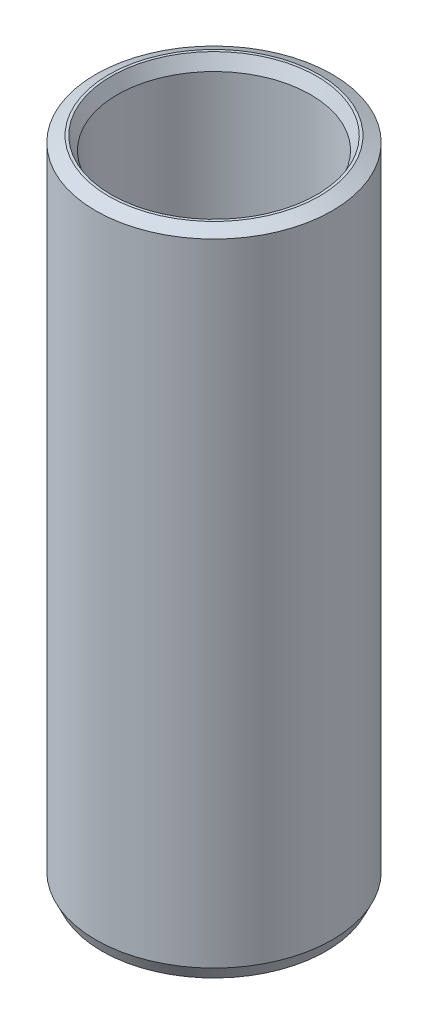
ISO-10303-21;
HEADER;
FILE_DESCRIPTION(('STEP AP214'),'2;1');
FILE_NAME('part.step','',(''),(''),'','','');
FILE_SCHEMA(('AUTOMOTIVE_DESIGN { 1 0 10303 214 1 1 1 1 }'));
ENDSEC;
DATA;
#1=APPLICATION_CONTEXT('core data for automotive mechanical design processes');
#2=APPLICATION_PROTOCOL_DEFINITION('international standard','automotive_design',2000,#1);
#3=PRODUCT_CONTEXT('',#1,'mechanical');
#4=PRODUCT('Part','Part','',(#3));
#5=PRODUCT_RELATED_PRODUCT_CATEGORY('part','',(#4));
#6=PRODUCT_DEFINITION_FORMATION('','',#4);
#7=PRODUCT_DEFINITION_CONTEXT('part definition',#1,'design');
#8=PRODUCT_DEFINITION('design','',#6,#7);
#9=PRODUCT_DEFINITION_SHAPE('','',#8);
#10=(LENGTH_UNIT() NAMED_UNIT(*) SI_UNIT(.MILLI.,.METRE.));
#11=(NAMED_UNIT(*) PLANE_ANGLE_UNIT() SI_UNIT($,.RADIAN.));
#12=(NAMED_UNIT(*) SI_UNIT($,.STERADIAN.) SOLID_ANGLE_UNIT());
#13=UNCERTAINTY_MEASURE_WITH_UNIT(LENGTH_MEASURE(1.E-05),#10,'distance_accuracy_value','');
#14=(GEOMETRIC_REPRESENTATION_CONTEXT(3) GLOBAL_UNCERTAINTY_ASSIGNED_CONTEXT((#13)) GLOBAL_UNIT_ASSIGNED_CONTEXT((#10,
#11,#12)) REPRESENTATION_CONTEXT('',''));
#15=CARTESIAN_POINT('',(0.,0.,0.));
#16=DIRECTION('',(0.,0.,1.));
#17=DIRECTION('',(1.,0.,0.));
#18=AXIS2_PLACEMENT_3D('',#15,#16,#17);
#19=CARTESIAN_POINT('',(0.,206.250763122994,0.));
#20=DIRECTION('',(0.,-1.,0.));
#21=DIRECTION('',(0.,0.,-1.));
#22=AXIS2_PLACEMENT_3D('',#19,#20,#21);
#23=CYLINDRICAL_SURFACE('',#22,37.5);
#24=CARTESIAN_POINT('',(0.,4.09659132002466,0.));
#25=DIRECTION('',(0.,1.,0.));
#26=DIRECTION('',(0.,0.,1.));
#27=AXIS2_PLACEMENT_3D('',#24,#25,#26);
#28=CIRCLE('',#27,37.5);
#29=CARTESIAN_POINT('',(0.,4.09659132002466,37.5));
#30=VERTEX_POINT('',#29);
#31=EDGE_CURVE('E10',#30,#30,#28,.T.);
#32=ORIENTED_EDGE('',*,*,#31,.T.);
#33=EDGE_LOOP('',(#32));
#34=FACE_BOUND('',#33,.T.);
#35=CARTESIAN_POINT('',(0.,204.300845733352,0.));
#36=DIRECTION('',(0.,1.,0.));
#37=DIRECTION('',(0.,0.,1.));
#38=AXIS2_PLACEMENT_3D('',#35,#36,#37);
#39=CIRCLE('',#38,37.5);
#40=CARTESIAN_POINT('',(0.,204.300845733352,37.5));
#41=VERTEX_POINT('',#40);
#42=EDGE_CURVE('E50',#41,#41,#39,.F.);
#43=ORIENTED_EDGE('',*,*,#42,.T.);
#44=EDGE_LOOP('',(#43));
#45=FACE_BOUND('',#44,.T.);
#46=ADVANCED_FACE('F39',(#34,#45),#23,.T.);
#47=CARTESIAN_POINT('',(0.,206.250763122994,0.));
#48=DIRECTION('',(0.,1.,0.));
#49=DIRECTION('',(0.,0.,1.));
#50=AXIS2_PLACEMENT_3D('',#47,#48,#49);
#51=PLANE('',#50);
#52=CARTESIAN_POINT('',(0.,206.250763122994,0.));
#53=DIRECTION('',(0.,1.,0.));
#54=DIRECTION('',(0.,0.,1.));
#55=AXIS2_PLACEMENT_3D('',#52,#53,#54);
#56=CIRCLE('',#55,32.5789280560539);
#57=CARTESIAN_POINT('',(0.,206.250763122994,32.5789280560539));
#58=VERTEX_POINT('',#57);
#59=EDGE_CURVE('E58',#58,#58,#56,.F.);
#60=ORIENTED_EDGE('',*,*,#59,.T.);
#61=EDGE_LOOP('',(#60));
#62=FACE_BOUND('',#61,.T.);
#63=CARTESIAN_POINT('',(0.,206.250763122994,0.));
#64=DIRECTION('',(0.,1.,0.));
#65=DIRECTION('',(0.,0.,1.));
#66=AXIS2_PLACEMENT_3D('',#63,#64,#65);
#67=CIRCLE('',#66,33.4034086799754);
#68=CARTESIAN_POINT('',(0.,206.250763122994,33.4034086799754));
#69=VERTEX_POINT('',#68);
#70=EDGE_CURVE('E61',#69,#69,#67,.T.);
#71=ORIENTED_EDGE('',*,*,#70,.T.);
#72=EDGE_LOOP('',(#71));
#73=FACE_BOUND('',#72,.T.);
#74=ADVANCED_FACE('F88',(#62,#73),#51,.T.);
#75=CARTESIAN_POINT('',(0.,0.,0.));
#76=DIRECTION('',(0.,1.,0.));
#77=DIRECTION('',(0.,0.,1.));
#78=AXIS2_PLACEMENT_3D('',#75,#76,#77);
#79=PLANE('',#78);
#80=CARTESIAN_POINT('',(0.,0.,0.));
#81=DIRECTION('',(0.,1.,0.));
#82=DIRECTION('',(0.,0.,1.));
#83=AXIS2_PLACEMENT_3D('',#80,#81,#82);
#84=CIRCLE('',#83,34.725601986437);
#85=CARTESIAN_POINT('',(0.,0.,34.725601986437));
#86=VERTEX_POINT('',#85);
#87=EDGE_CURVE('E51',#86,#86,#84,.T.);
#88=ORIENTED_EDGE('',*,*,#87,.T.);
#89=EDGE_LOOP('',(#88));
#90=FACE_BOUND('',#89,.T.);
#91=CARTESIAN_POINT('',(0.,0.,0.));
#92=DIRECTION('',(0.,1.,0.));
#93=DIRECTION('',(0.,0.,1.));
#94=AXIS2_PLACEMENT_3D('',#91,#92,#93);
#95=CIRCLE('',#94,35.5500826103585);
#96=CARTESIAN_POINT('',(0.,0.,35.5500826103585));
#97=VERTEX_POINT('',#96);
#98=EDGE_CURVE('E54',#97,#97,#95,.F.);
#99=ORIENTED_EDGE('',*,*,#98,.T.);
#100=EDGE_LOOP('',(#99));
#101=FACE_BOUND('',#100,.T.);
#102=ADVANCED_FACE('F83',(#90,#101),#79,.F.);
#103=CARTESIAN_POINT('',(0.,206.250763122994,0.));
#104=DIRECTION('',(0.,-1.,0.));
#105=DIRECTION('',(0.,0.,-1.));
#106=AXIS2_PLACEMENT_3D('',#103,#104,#105);
#107=CYLINDRICAL_SURFACE('',#106,30.6290106664124);
#108=CARTESIAN_POINT('',(0.,202.154171802969,0.));
#109=DIRECTION('',(0.,1.,0.));
#110=DIRECTION('',(0.,0.,1.));
#111=AXIS2_PLACEMENT_3D('',#108,#109,#110);
#112=CIRCLE('',#111,30.6290106664124);
#113=CARTESIAN_POINT('',(0.,202.154171802969,30.6290106664124));
#114=VERTEX_POINT('',#113);
#115=EDGE_CURVE('E67',#114,#114,#112,.T.);
#116=ORIENTED_EDGE('',*,*,#115,.T.);
#117=EDGE_LOOP('',(#116));
#118=FACE_BOUND('',#117,.T.);
#119=CARTESIAN_POINT('',(0.,1.94991738964151,0.));
#120=DIRECTION('',(0.,1.,0.));
#121=DIRECTION('',(0.,0.,1.));
#122=AXIS2_PLACEMENT_3D('',#119,#120,#121);
#123=CIRCLE('',#122,30.6290106664124);
#124=CARTESIAN_POINT('',(0.,1.94991738964151,30.6290106664124));
#125=VERTEX_POINT('',#124);
#126=EDGE_CURVE('E69',#125,#125,#123,.F.);
#127=ORIENTED_EDGE('',*,*,#126,.T.);
#128=EDGE_LOOP('',(#127));
#129=FACE_BOUND('',#128,.T.);
#130=ADVANCED_FACE('F71',(#118,#129),#107,.F.);
#131=CARTESIAN_POINT('',(0.,202.154171802969,0.));
#132=DIRECTION('',(0.,1.,0.));
#133=DIRECTION('',(0.,0.,1.));
#134=AXIS2_PLACEMENT_3D('',#131,#132,#133);
#135=CONICAL_SURFACE('',#134,30.6290106664124,0.444251973850893);
#136=ORIENTED_EDGE('',*,*,#59,.F.);
#137=EDGE_LOOP('',(#136));
#138=FACE_BOUND('',#137,.T.);
#139=ORIENTED_EDGE('',*,*,#115,.F.);
#140=EDGE_LOOP('',(#139));
#141=FACE_BOUND('',#140,.T.);
#142=ADVANCED_FACE('F77',(#138,#141),#135,.F.);
#143=CARTESIAN_POINT('',(0.,0.,0.));
#144=DIRECTION('',(0.,-1.,0.));
#145=DIRECTION('',(0.,0.,-1.));
#146=AXIS2_PLACEMENT_3D('',#143,#144,#145);
#147=CONICAL_SURFACE('',#146,34.725601986437,1.126544352944);
#148=ORIENTED_EDGE('',*,*,#126,.F.);
#149=EDGE_LOOP('',(#148));
#150=FACE_BOUND('',#149,.T.);
#151=ORIENTED_EDGE('',*,*,#87,.F.);
#152=EDGE_LOOP('',(#151));
#153=FACE_BOUND('',#152,.T.);
#154=ADVANCED_FACE('F73',(#150,#153),#147,.F.);
#155=CARTESIAN_POINT('',(0.,4.09659132002466,0.));
#156=DIRECTION('',(0.,1.,0.));
#157=DIRECTION('',(0.,0.,1.));
#158=AXIS2_PLACEMENT_3D('',#155,#156,#157);
#159=CONICAL_SURFACE('',#158,37.5,0.444251973850893);
#160=ORIENTED_EDGE('',*,*,#98,.F.);
#161=EDGE_LOOP('',(#160));
#162=FACE_BOUND('',#161,.T.);
#163=ORIENTED_EDGE('',*,*,#31,.F.);
#164=EDGE_LOOP('',(#163));
#165=FACE_BOUND('',#164,.T.);
#166=ADVANCED_FACE('F76',(#162,#165),#159,.T.);
#167=CARTESIAN_POINT('',(0.,206.250763122994,0.));
#168=DIRECTION('',(0.,-1.,0.));
#169=DIRECTION('',(0.,0.,-1.));
#170=AXIS2_PLACEMENT_3D('',#167,#168,#169);
#171=CONICAL_SURFACE('',#170,33.4034086799754,1.126544352944);
#172=ORIENTED_EDGE('',*,*,#42,.F.);
#173=EDGE_LOOP('',(#172));
#174=FACE_BOUND('',#173,.T.);
#175=ORIENTED_EDGE('',*,*,#70,.F.);
#176=EDGE_LOOP('',(#175));
#177=FACE_BOUND('',#176,.T.);
#178=ADVANCED_FACE('F45',(#174,#177),#171,.T.);
#179=CLOSED_SHELL('',(#46,#74,#102,#130,#142,#154,#166,#178));
#180=MANIFOLD_SOLID_BREP('B2',#179);
#181=ADVANCED_BREP_SHAPE_REPRESENTATION('',(#18,#180),#14);
#182=SHAPE_DEFINITION_REPRESENTATION(#9,#181);
ENDSEC;
END-ISO-10303-21;
